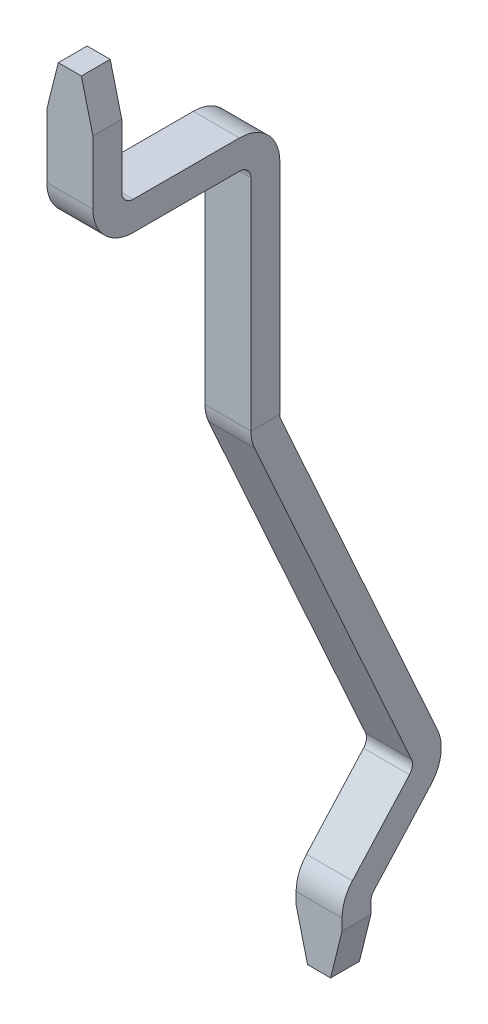
ISO-10303-21;
HEADER;
FILE_DESCRIPTION(('STEP AP214'),'2;1');
FILE_NAME('part.step','',(''),(''),'','','');
FILE_SCHEMA(('AUTOMOTIVE_DESIGN { 1 0 10303 214 1 1 1 1 }'));
ENDSEC;
DATA;
#1=APPLICATION_CONTEXT('core data for automotive mechanical design processes');
#2=APPLICATION_PROTOCOL_DEFINITION('international standard','automotive_design',2000,#1);
#3=PRODUCT_CONTEXT('',#1,'mechanical');
#4=PRODUCT('Part','Part','',(#3));
#5=PRODUCT_RELATED_PRODUCT_CATEGORY('part','',(#4));
#6=PRODUCT_DEFINITION_FORMATION('','',#4);
#7=PRODUCT_DEFINITION_CONTEXT('part definition',#1,'design');
#8=PRODUCT_DEFINITION('design','',#6,#7);
#9=PRODUCT_DEFINITION_SHAPE('','',#8);
#10=(LENGTH_UNIT() NAMED_UNIT(*) SI_UNIT(.MILLI.,.METRE.));
#11=(NAMED_UNIT(*) PLANE_ANGLE_UNIT() SI_UNIT($,.RADIAN.));
#12=(NAMED_UNIT(*) SI_UNIT($,.STERADIAN.) SOLID_ANGLE_UNIT());
#13=UNCERTAINTY_MEASURE_WITH_UNIT(LENGTH_MEASURE(1.E-05),#10,'distance_accuracy_value','');
#14=(GEOMETRIC_REPRESENTATION_CONTEXT(3) GLOBAL_UNCERTAINTY_ASSIGNED_CONTEXT((#13)) GLOBAL_UNIT_ASSIGNED_CONTEXT((#10,
#11,#12)) REPRESENTATION_CONTEXT('',''));
#15=CARTESIAN_POINT('',(0.,0.,0.));
#16=DIRECTION('',(0.,0.,1.));
#17=DIRECTION('',(1.,0.,0.));
#18=AXIS2_PLACEMENT_3D('',#15,#16,#17);
#19=CARTESIAN_POINT('',(1.6,4.575,1.945));
#20=DIRECTION('',(0.,-1.,0.));
#21=DIRECTION('',(0.,0.,-1.));
#22=AXIS2_PLACEMENT_3D('',#19,#20,#21);
#23=PLANE('',#22);
#24=DIRECTION('',(0.,0.,1.));
#25=VECTOR('',#24,1.);
#26=CARTESIAN_POINT('',(1.5,4.575,8.99552393868072));
#27=LINE('',#26,#25);
#28=CARTESIAN_POINT('',(1.5,4.575,1.82));
#29=VERTEX_POINT('',#28);
#30=CARTESIAN_POINT('',(1.5,4.575,2.07));
#31=VERTEX_POINT('',#30);
#32=EDGE_CURVE('E263',#29,#31,#27,.T.);
#33=ORIENTED_EDGE('',*,*,#32,.T.);
#34=DIRECTION('',(-1.,0.,0.));
#35=VECTOR('',#34,1.);
#36=CARTESIAN_POINT('',(1.8,4.575,2.07));
#37=LINE('',#36,#35);
#38=CARTESIAN_POINT('',(1.7,4.575,2.07));
#39=VERTEX_POINT('',#38);
#40=EDGE_CURVE('E234',#31,#39,#37,.F.);
#41=ORIENTED_EDGE('',*,*,#40,.T.);
#42=DIRECTION('',(0.,0.,1.));
#43=VECTOR('',#42,1.);
#44=CARTESIAN_POINT('',(1.7,4.575,8.99552883706733));
#45=LINE('',#44,#43);
#46=CARTESIAN_POINT('',(1.7,4.575,1.82));
#47=VERTEX_POINT('',#46);
#48=EDGE_CURVE('E213',#47,#39,#45,.T.);
#49=ORIENTED_EDGE('',*,*,#48,.F.);
#50=DIRECTION('',(1.,0.,0.));
#51=VECTOR('',#50,1.);
#52=CARTESIAN_POINT('',(1.4,4.575,1.82));
#53=LINE('',#52,#51);
#54=EDGE_CURVE('E250',#47,#29,#53,.F.);
#55=ORIENTED_EDGE('',*,*,#54,.T.);
#56=EDGE_LOOP('',(#33,#41,#49,#55));
#57=FACE_BOUND('',#56,.T.);
#58=ADVANCED_FACE('F16',(#57),#23,.F.);
#59=CARTESIAN_POINT('',(1.5,4.575,8.99552393868072));
#60=DIRECTION('',(0.970142500145331,-0.242535625036336,0.));
#61=DIRECTION('',(0.242535625036336,0.970142500145331,0.));
#62=AXIS2_PLACEMENT_3D('',#59,#60,#61);
#63=PLANE('',#62);
#64=DIRECTION('',(0.242535625036333,0.970142500145332,0.));
#65=VECTOR('',#64,1.);
#66=CARTESIAN_POINT('',(1.4,4.175,2.07));
#67=LINE('',#66,#65);
#68=CARTESIAN_POINT('',(1.4,4.175,2.07));
#69=VERTEX_POINT('',#68);
#70=EDGE_CURVE('E201',#69,#31,#67,.T.);
#71=ORIENTED_EDGE('',*,*,#70,.T.);
#72=ORIENTED_EDGE('',*,*,#32,.F.);
#73=DIRECTION('',(-0.242535625036333,-0.970142500145332,0.));
#74=VECTOR('',#73,1.);
#75=CARTESIAN_POINT('',(1.5,4.575,1.82));
#76=LINE('',#75,#74);
#77=CARTESIAN_POINT('',(1.4,4.175,1.82));
#78=VERTEX_POINT('',#77);
#79=EDGE_CURVE('E230',#29,#78,#76,.T.);
#80=ORIENTED_EDGE('',*,*,#79,.T.);
#81=DIRECTION('',(0.,0.,1.));
#82=VECTOR('',#81,1.);
#83=CARTESIAN_POINT('',(1.4,4.175,2.07));
#84=LINE('',#83,#82);
#85=EDGE_CURVE('E241',#78,#69,#84,.T.);
#86=ORIENTED_EDGE('',*,*,#85,.T.);
#87=EDGE_LOOP('',(#71,#72,#80,#86));
#88=FACE_BOUND('',#87,.T.);
#89=ADVANCED_FACE('F400',(#88),#63,.F.);
#90=CARTESIAN_POINT('',(1.4,4.575,1.82));
#91=DIRECTION('',(0.,0.,1.));
#92=DIRECTION('',(0.,-1.,0.));
#93=AXIS2_PLACEMENT_3D('',#90,#91,#92);
#94=PLANE('',#93);
#95=ORIENTED_EDGE('',*,*,#79,.F.);
#96=ORIENTED_EDGE('',*,*,#54,.F.);
#97=DIRECTION('',(-0.242535625036336,0.970142500145331,0.));
#98=VECTOR('',#97,1.);
#99=CARTESIAN_POINT('',(1.7,4.575,1.82));
#100=LINE('',#99,#98);
#101=CARTESIAN_POINT('',(1.8,4.175,1.82));
#102=VERTEX_POINT('',#101);
#103=EDGE_CURVE('E231',#102,#47,#100,.T.);
#104=ORIENTED_EDGE('',*,*,#103,.F.);
#105=DIRECTION('',(0.,1.,0.));
#106=VECTOR('',#105,1.);
#107=CARTESIAN_POINT('',(1.8,4.575,1.82));
#108=LINE('',#107,#106);
#109=CARTESIAN_POINT('',(1.8,3.625,1.82));
#110=VERTEX_POINT('',#109);
#111=EDGE_CURVE('E220',#102,#110,#108,.F.);
#112=ORIENTED_EDGE('',*,*,#111,.T.);
#113=DIRECTION('',(1.,0.,0.));
#114=VECTOR('',#113,1.);
#115=CARTESIAN_POINT('',(1.6,3.625,1.81999999999999));
#116=LINE('',#115,#114);
#117=CARTESIAN_POINT('',(1.4,3.625,1.82));
#118=VERTEX_POINT('',#117);
#119=EDGE_CURVE('E228',#110,#118,#116,.F.);
#120=ORIENTED_EDGE('',*,*,#119,.T.);
#121=DIRECTION('',(0.,1.,0.));
#122=VECTOR('',#121,1.);
#123=CARTESIAN_POINT('',(1.4,4.575,1.82));
#124=LINE('',#123,#122);
#125=EDGE_CURVE('E245',#118,#78,#124,.T.);
#126=ORIENTED_EDGE('',*,*,#125,.T.);
#127=EDGE_LOOP('',(#95,#96,#104,#112,#120,#126));
#128=FACE_BOUND('',#127,.T.);
#129=ADVANCED_FACE('F395',(#128),#94,.F.);
#130=CARTESIAN_POINT('',(1.6,3.625,1.72));
#131=DIRECTION('',(1.,0.,0.));
#132=DIRECTION('',(0.,1.,0.));
#133=AXIS2_PLACEMENT_3D('',#130,#131,#132);
#134=CYLINDRICAL_SURFACE('',#133,0.0999999999999946);
#135=ORIENTED_EDGE('',*,*,#119,.F.);
#136=CARTESIAN_POINT('',(1.8,3.625,1.72));
#137=DIRECTION('',(1.,0.,0.));
#138=DIRECTION('',(0.,1.,0.));
#139=AXIS2_PLACEMENT_3D('',#136,#137,#138);
#140=CIRCLE('',#139,0.0999999999999946);
#141=CARTESIAN_POINT('',(1.8,3.525,1.72));
#142=VERTEX_POINT('',#141);
#143=EDGE_CURVE('E334',#110,#142,#140,.T.);
#144=ORIENTED_EDGE('',*,*,#143,.T.);
#145=DIRECTION('',(1.,0.,0.));
#146=VECTOR('',#145,1.);
#147=CARTESIAN_POINT('',(1.4,3.525,1.72));
#148=LINE('',#147,#146);
#149=CARTESIAN_POINT('',(1.4,3.525,1.72));
#150=VERTEX_POINT('',#149);
#151=EDGE_CURVE('E226',#142,#150,#148,.F.);
#152=ORIENTED_EDGE('',*,*,#151,.T.);
#153=CARTESIAN_POINT('',(1.4,3.625,1.72));
#154=DIRECTION('',(1.,0.,0.));
#155=DIRECTION('',(0.,1.,0.));
#156=AXIS2_PLACEMENT_3D('',#153,#154,#155);
#157=CIRCLE('',#156,0.0999999999999946);
#158=EDGE_CURVE('E339',#150,#118,#157,.F.);
#159=ORIENTED_EDGE('',*,*,#158,.T.);
#160=EDGE_LOOP('',(#135,#144,#152,#159));
#161=FACE_BOUND('',#160,.T.);
#162=ADVANCED_FACE('F392',(#161),#134,.F.);
#163=CARTESIAN_POINT('',(1.4,3.525,1.72));
#164=DIRECTION('',(0.,-1.,0.));
#165=DIRECTION('',(0.,0.,-1.));
#166=AXIS2_PLACEMENT_3D('',#163,#164,#165);
#167=PLANE('',#166);
#168=ORIENTED_EDGE('',*,*,#151,.F.);
#169=DIRECTION('',(0.,0.,1.));
#170=VECTOR('',#169,1.);
#171=CARTESIAN_POINT('',(1.8,3.525,1.82));
#172=LINE('',#171,#170);
#173=CARTESIAN_POINT('',(1.8,3.525,0.800000000000004));
#174=VERTEX_POINT('',#173);
#175=EDGE_CURVE('E333',#142,#174,#172,.F.);
#176=ORIENTED_EDGE('',*,*,#175,.T.);
#177=DIRECTION('',(-1.,0.,0.));
#178=VECTOR('',#177,1.);
#179=CARTESIAN_POINT('',(1.6,3.525,0.800000000000004));
#180=LINE('',#179,#178);
#181=CARTESIAN_POINT('',(1.4,3.525,0.800000000000004));
#182=VERTEX_POINT('',#181);
#183=EDGE_CURVE('E177',#182,#174,#180,.F.);
#184=ORIENTED_EDGE('',*,*,#183,.F.);
#185=DIRECTION('',(0.,0.,1.));
#186=VECTOR('',#185,1.);
#187=CARTESIAN_POINT('',(1.4,3.525,2.07));
#188=LINE('',#187,#186);
#189=EDGE_CURVE('E342',#182,#150,#188,.T.);
#190=ORIENTED_EDGE('',*,*,#189,.T.);
#191=EDGE_LOOP('',(#168,#176,#184,#190));
#192=FACE_BOUND('',#191,.T.);
#193=ADVANCED_FACE('F383',(#192),#167,.F.);
#194=CARTESIAN_POINT('',(1.6,3.175,0.800000000000004));
#195=DIRECTION('',(-1.,0.,0.));
#196=DIRECTION('',(0.,-1.,0.));
#197=AXIS2_PLACEMENT_3D('',#194,#195,#196);
#198=CYLINDRICAL_SURFACE('',#197,0.350000000000005);
#199=CARTESIAN_POINT('',(1.8,3.175,0.800000000000004));
#200=DIRECTION('',(-1.,0.,0.));
#201=DIRECTION('',(0.,-1.,0.));
#202=AXIS2_PLACEMENT_3D('',#199,#200,#201);
#203=CIRCLE('',#202,0.350000000000005);
#204=CARTESIAN_POINT('',(1.8,3.175,0.45));
#205=VERTEX_POINT('',#204);
#206=EDGE_CURVE('E329',#174,#205,#203,.T.);
#207=ORIENTED_EDGE('',*,*,#206,.T.);
#208=DIRECTION('',(1.,0.,0.));
#209=VECTOR('',#208,1.);
#210=CARTESIAN_POINT('',(1.4,3.175,0.45));
#211=LINE('',#210,#209);
#212=CARTESIAN_POINT('',(1.4,3.175,0.45));
#213=VERTEX_POINT('',#212);
#214=EDGE_CURVE('E217',#205,#213,#211,.F.);
#215=ORIENTED_EDGE('',*,*,#214,.T.);
#216=CARTESIAN_POINT('',(1.4,3.175,0.800000000000004));
#217=DIRECTION('',(-1.,0.,0.));
#218=DIRECTION('',(0.,-1.,0.));
#219=AXIS2_PLACEMENT_3D('',#216,#217,#218);
#220=CIRCLE('',#219,0.350000000000005);
#221=EDGE_CURVE('E187',#213,#182,#220,.F.);
#222=ORIENTED_EDGE('',*,*,#221,.T.);
#223=ORIENTED_EDGE('',*,*,#183,.T.);
#224=EDGE_LOOP('',(#207,#215,#222,#223));
#225=FACE_BOUND('',#224,.T.);
#226=ADVANCED_FACE('F388',(#225),#198,.T.);
#227=CARTESIAN_POINT('',(1.4,3.175,0.45));
#228=DIRECTION('',(0.,0.,1.));
#229=DIRECTION('',(0.,-1.,0.));
#230=AXIS2_PLACEMENT_3D('',#227,#228,#229);
#231=PLANE('',#230);
#232=ORIENTED_EDGE('',*,*,#214,.F.);
#233=DIRECTION('',(0.,1.,0.));
#234=VECTOR('',#233,1.);
#235=CARTESIAN_POINT('',(1.8,4.575,0.449999999999999));
#236=LINE('',#235,#234);
#237=CARTESIAN_POINT('',(1.8,1.275,0.449999999999999));
#238=VERTEX_POINT('',#237);
#239=EDGE_CURVE('E332',#205,#238,#236,.F.);
#240=ORIENTED_EDGE('',*,*,#239,.T.);
#241=DIRECTION('',(1.,0.,0.));
#242=VECTOR('',#241,1.);
#243=CARTESIAN_POINT('',(1.79899999999999,1.275,0.449999999999998));
#244=LINE('',#243,#242);
#245=CARTESIAN_POINT('',(1.799,1.275,0.449999999999999));
#246=VERTEX_POINT('',#245);
#247=EDGE_CURVE('E223',#246,#238,#244,.T.);
#248=ORIENTED_EDGE('',*,*,#247,.F.);
#249=DIRECTION('',(1.,0.,0.));
#250=VECTOR('',#249,1.);
#251=CARTESIAN_POINT('',(1.4,1.275,0.45));
#252=LINE('',#251,#250);
#253=CARTESIAN_POINT('',(1.401,1.275,0.449999999999999));
#254=VERTEX_POINT('',#253);
#255=EDGE_CURVE('E173',#254,#246,#252,.T.);
#256=ORIENTED_EDGE('',*,*,#255,.F.);
#257=DIRECTION('',(1.,0.,0.));
#258=VECTOR('',#257,1.);
#259=CARTESIAN_POINT('',(1.401,1.275,0.45));
#260=LINE('',#259,#258);
#261=CARTESIAN_POINT('',(1.4,1.275,0.45));
#262=VERTEX_POINT('',#261);
#263=EDGE_CURVE('E19',#262,#254,#260,.T.);
#264=ORIENTED_EDGE('',*,*,#263,.F.);
#265=DIRECTION('',(0.,1.,0.));
#266=VECTOR('',#265,1.);
#267=CARTESIAN_POINT('',(1.4,4.575,0.45));
#268=LINE('',#267,#266);
#269=EDGE_CURVE('E171',#262,#213,#268,.T.);
#270=ORIENTED_EDGE('',*,*,#269,.T.);
#271=EDGE_LOOP('',(#232,#240,#248,#256,#264,#270));
#272=FACE_BOUND('',#271,.T.);
#273=ADVANCED_FACE('F170',(#272),#231,.F.);
#274=CARTESIAN_POINT('',(1.8,3.275,1.72));
#275=DIRECTION('',(0.,1.,0.));
#276=DIRECTION('',(0.,0.,1.));
#277=AXIS2_PLACEMENT_3D('',#274,#275,#276);
#278=PLANE('',#277);
#279=DIRECTION('',(1.,0.,0.));
#280=VECTOR('',#279,1.);
#281=CARTESIAN_POINT('',(1.6,3.27500000000001,1.72));
#282=LINE('',#281,#280);
#283=CARTESIAN_POINT('',(1.4,3.275,1.72));
#284=VERTEX_POINT('',#283);
#285=CARTESIAN_POINT('',(1.8,3.275,1.72));
#286=VERTEX_POINT('',#285);
#287=EDGE_CURVE('E202',#284,#286,#282,.T.);
#288=ORIENTED_EDGE('',*,*,#287,.F.);
#289=DIRECTION('',(0.,0.,1.));
#290=VECTOR('',#289,1.);
#291=CARTESIAN_POINT('',(1.4,3.275,2.07));
#292=LINE('',#291,#290);
#293=CARTESIAN_POINT('',(1.4,3.275,0.800000000000004));
#294=VERTEX_POINT('',#293);
#295=EDGE_CURVE('E193',#284,#294,#292,.F.);
#296=ORIENTED_EDGE('',*,*,#295,.T.);
#297=DIRECTION('',(-1.,0.,0.));
#298=VECTOR('',#297,1.);
#299=CARTESIAN_POINT('',(1.6,3.275,0.800000000000004));
#300=LINE('',#299,#298);
#301=CARTESIAN_POINT('',(1.8,3.275,0.800000000000004));
#302=VERTEX_POINT('',#301);
#303=EDGE_CURVE('E218',#294,#302,#300,.F.);
#304=ORIENTED_EDGE('',*,*,#303,.T.);
#305=DIRECTION('',(0.,0.,1.));
#306=VECTOR('',#305,1.);
#307=CARTESIAN_POINT('',(1.8,3.275,1.82));
#308=LINE('',#307,#306);
#309=EDGE_CURVE('E324',#302,#286,#308,.T.);
#310=ORIENTED_EDGE('',*,*,#309,.T.);
#311=EDGE_LOOP('',(#288,#296,#304,#310));
#312=FACE_BOUND('',#311,.T.);
#313=ADVANCED_FACE('F534',(#312),#278,.F.);
#314=CARTESIAN_POINT('',(1.6,3.625,1.72));
#315=DIRECTION('',(1.,0.,0.));
#316=DIRECTION('',(0.,1.,0.));
#317=AXIS2_PLACEMENT_3D('',#314,#315,#316);
#318=CYLINDRICAL_SURFACE('',#317,0.349999999999995);
#319=CARTESIAN_POINT('',(1.4,3.625,1.72));
#320=DIRECTION('',(1.,0.,0.));
#321=DIRECTION('',(0.,1.,0.));
#322=AXIS2_PLACEMENT_3D('',#319,#320,#321);
#323=CIRCLE('',#322,0.349999999999995);
#324=CARTESIAN_POINT('',(1.4,3.625,2.07));
#325=VERTEX_POINT('',#324);
#326=EDGE_CURVE('E195',#325,#284,#323,.T.);
#327=ORIENTED_EDGE('',*,*,#326,.T.);
#328=ORIENTED_EDGE('',*,*,#287,.T.);
#329=CARTESIAN_POINT('',(1.8,3.625,1.72));
#330=DIRECTION('',(1.,0.,0.));
#331=DIRECTION('',(0.,1.,0.));
#332=AXIS2_PLACEMENT_3D('',#329,#330,#331);
#333=CIRCLE('',#332,0.349999999999995);
#334=CARTESIAN_POINT('',(1.8,3.625,2.07));
#335=VERTEX_POINT('',#334);
#336=EDGE_CURVE('E321',#286,#335,#333,.F.);
#337=ORIENTED_EDGE('',*,*,#336,.T.);
#338=DIRECTION('',(-1.,0.,0.));
#339=VECTOR('',#338,1.);
#340=CARTESIAN_POINT('',(1.8,3.625,2.07));
#341=LINE('',#340,#339);
#342=EDGE_CURVE('E198',#335,#325,#341,.T.);
#343=ORIENTED_EDGE('',*,*,#342,.T.);
#344=EDGE_LOOP('',(#327,#328,#337,#343));
#345=FACE_BOUND('',#344,.T.);
#346=ADVANCED_FACE('F531',(#345),#318,.T.);
#347=CARTESIAN_POINT('',(1.8,4.575,2.07));
#348=DIRECTION('',(0.,0.,-1.));
#349=DIRECTION('',(-1.,0.,0.));
#350=AXIS2_PLACEMENT_3D('',#347,#348,#349);
#351=PLANE('',#350);
#352=ORIENTED_EDGE('',*,*,#70,.F.);
#353=DIRECTION('',(0.,1.,0.));
#354=VECTOR('',#353,1.);
#355=CARTESIAN_POINT('',(1.4,4.575,2.07));
#356=LINE('',#355,#354);
#357=EDGE_CURVE('E244',#69,#325,#356,.F.);
#358=ORIENTED_EDGE('',*,*,#357,.T.);
#359=ORIENTED_EDGE('',*,*,#342,.F.);
#360=DIRECTION('',(0.,1.,0.));
#361=VECTOR('',#360,1.);
#362=CARTESIAN_POINT('',(1.8,4.575,2.07));
#363=LINE('',#362,#361);
#364=CARTESIAN_POINT('',(1.8,4.175,2.07));
#365=VERTEX_POINT('',#364);
#366=EDGE_CURVE('E207',#335,#365,#363,.T.);
#367=ORIENTED_EDGE('',*,*,#366,.T.);
#368=DIRECTION('',(-0.242535625036336,0.970142500145331,0.));
#369=VECTOR('',#368,1.);
#370=CARTESIAN_POINT('',(1.7,4.575,2.07));
#371=LINE('',#370,#369);
#372=EDGE_CURVE('E210',#39,#365,#371,.F.);
#373=ORIENTED_EDGE('',*,*,#372,.F.);
#374=ORIENTED_EDGE('',*,*,#40,.F.);
#375=EDGE_LOOP('',(#352,#358,#359,#367,#373,#374));
#376=FACE_BOUND('',#375,.T.);
#377=ADVANCED_FACE('F527',(#376),#351,.F.);
#378=CARTESIAN_POINT('',(1.7,4.575,8.99552883706733));
#379=DIRECTION('',(0.970142500145331,0.242535625036336,0.));
#380=DIRECTION('',(-0.242535625036336,0.970142500145331,0.));
#381=AXIS2_PLACEMENT_3D('',#378,#379,#380);
#382=PLANE('',#381);
#383=ORIENTED_EDGE('',*,*,#372,.T.);
#384=DIRECTION('',(0.,0.,1.));
#385=VECTOR('',#384,1.);
#386=CARTESIAN_POINT('',(1.8,4.175,1.82));
#387=LINE('',#386,#385);
#388=EDGE_CURVE('E203',#365,#102,#387,.F.);
#389=ORIENTED_EDGE('',*,*,#388,.T.);
#390=ORIENTED_EDGE('',*,*,#103,.T.);
#391=ORIENTED_EDGE('',*,*,#48,.T.);
#392=EDGE_LOOP('',(#383,#389,#390,#391));
#393=FACE_BOUND('',#392,.T.);
#394=ADVANCED_FACE('F524',(#393),#382,.T.);
#395=CARTESIAN_POINT('',(1.4,4.575,2.07));
#396=DIRECTION('',(1.,0.,0.));
#397=DIRECTION('',(0.,1.,0.));
#398=AXIS2_PLACEMENT_3D('',#395,#396,#397);
#399=PLANE('',#398);
#400=ORIENTED_EDGE('',*,*,#85,.F.);
#401=ORIENTED_EDGE('',*,*,#125,.F.);
#402=ORIENTED_EDGE('',*,*,#158,.F.);
#403=ORIENTED_EDGE('',*,*,#189,.F.);
#404=ORIENTED_EDGE('',*,*,#221,.F.);
#405=ORIENTED_EDGE('',*,*,#269,.F.);
#406=DIRECTION('',(0.,0.,1.));
#407=VECTOR('',#406,1.);
#408=CARTESIAN_POINT('',(1.4,1.275,2.07));
#409=LINE('',#408,#407);
#410=CARTESIAN_POINT('',(1.4,1.275,0.7));
#411=VERTEX_POINT('',#410);
#412=EDGE_CURVE('E183',#411,#262,#409,.F.);
#413=ORIENTED_EDGE('',*,*,#412,.F.);
#414=DIRECTION('',(0.,1.,0.));
#415=VECTOR('',#414,1.);
#416=CARTESIAN_POINT('',(1.4,3.175,0.7));
#417=LINE('',#416,#415);
#418=CARTESIAN_POINT('',(1.4,3.175,0.7));
#419=VERTEX_POINT('',#418);
#420=EDGE_CURVE('E206',#411,#419,#417,.T.);
#421=ORIENTED_EDGE('',*,*,#420,.T.);
#422=CARTESIAN_POINT('',(1.4,3.175,0.800000000000004));
#423=DIRECTION('',(-1.,0.,0.));
#424=DIRECTION('',(0.,-1.,0.));
#425=AXIS2_PLACEMENT_3D('',#422,#423,#424);
#426=CIRCLE('',#425,0.100000000000005);
#427=EDGE_CURVE('E221',#419,#294,#426,.F.);
#428=ORIENTED_EDGE('',*,*,#427,.T.);
#429=ORIENTED_EDGE('',*,*,#295,.F.);
#430=ORIENTED_EDGE('',*,*,#326,.F.);
#431=ORIENTED_EDGE('',*,*,#357,.F.);
#432=EDGE_LOOP('',(#400,#401,#402,#403,#404,#405,#413,#421,#428,#429,#430,#431));
#433=FACE_BOUND('',#432,.T.);
#434=ADVANCED_FACE('F181',(#433),#399,.F.);
#435=CARTESIAN_POINT('',(1.6,3.175,0.800000000000004));
#436=DIRECTION('',(-1.,0.,0.));
#437=DIRECTION('',(0.,-1.,0.));
#438=AXIS2_PLACEMENT_3D('',#435,#436,#437);
#439=CYLINDRICAL_SURFACE('',#438,0.100000000000005);
#440=ORIENTED_EDGE('',*,*,#303,.F.);
#441=ORIENTED_EDGE('',*,*,#427,.F.);
#442=DIRECTION('',(-1.,0.,0.));
#443=VECTOR('',#442,1.);
#444=CARTESIAN_POINT('',(1.8,3.175,0.7));
#445=LINE('',#444,#443);
#446=CARTESIAN_POINT('',(1.8,3.175,0.7));
#447=VERTEX_POINT('',#446);
#448=EDGE_CURVE('E370',#419,#447,#445,.F.);
#449=ORIENTED_EDGE('',*,*,#448,.T.);
#450=CARTESIAN_POINT('',(1.8,3.175,0.800000000000004));
#451=DIRECTION('',(-1.,0.,0.));
#452=DIRECTION('',(0.,-1.,0.));
#453=AXIS2_PLACEMENT_3D('',#450,#451,#452);
#454=CIRCLE('',#453,0.100000000000005);
#455=EDGE_CURVE('E325',#447,#302,#454,.F.);
#456=ORIENTED_EDGE('',*,*,#455,.T.);
#457=EDGE_LOOP('',(#440,#441,#449,#456));
#458=FACE_BOUND('',#457,.T.);
#459=ADVANCED_FACE('F518',(#458),#439,.F.);
#460=CARTESIAN_POINT('',(1.8,4.575,1.82));
#461=DIRECTION('',(-1.,0.,0.));
#462=DIRECTION('',(0.,0.,1.));
#463=AXIS2_PLACEMENT_3D('',#460,#461,#462);
#464=PLANE('',#463);
#465=ORIENTED_EDGE('',*,*,#366,.F.);
#466=ORIENTED_EDGE('',*,*,#336,.F.);
#467=ORIENTED_EDGE('',*,*,#309,.F.);
#468=ORIENTED_EDGE('',*,*,#455,.F.);
#469=DIRECTION('',(0.,1.,0.));
#470=VECTOR('',#469,1.);
#471=CARTESIAN_POINT('',(1.8,3.175,0.7));
#472=LINE('',#471,#470);
#473=CARTESIAN_POINT('',(1.8,1.275,0.7));
#474=VERTEX_POINT('',#473);
#475=EDGE_CURVE('E358',#447,#474,#472,.F.);
#476=ORIENTED_EDGE('',*,*,#475,.T.);
#477=DIRECTION('',(0.,0.,1.));
#478=VECTOR('',#477,1.);
#479=CARTESIAN_POINT('',(1.8,1.275,1.82));
#480=LINE('',#479,#478);
#481=EDGE_CURVE('E328',#238,#474,#480,.T.);
#482=ORIENTED_EDGE('',*,*,#481,.F.);
#483=ORIENTED_EDGE('',*,*,#239,.F.);
#484=ORIENTED_EDGE('',*,*,#206,.F.);
#485=ORIENTED_EDGE('',*,*,#175,.F.);
#486=ORIENTED_EDGE('',*,*,#143,.F.);
#487=ORIENTED_EDGE('',*,*,#111,.F.);
#488=ORIENTED_EDGE('',*,*,#388,.F.);
#489=EDGE_LOOP('',(#465,#466,#467,#468,#476,#482,#483,#484,#485,#486,#487,#488));
#490=FACE_BOUND('',#489,.T.);
#491=ADVANCED_FACE('F355',(#490),#464,.F.);
#492=CARTESIAN_POINT('',(1.8,3.175,0.7));
#493=DIRECTION('',(0.,0.,-1.));
#494=DIRECTION('',(-1.,0.,0.));
#495=AXIS2_PLACEMENT_3D('',#492,#493,#494);
#496=PLANE('',#495);
#497=ORIENTED_EDGE('',*,*,#448,.F.);
#498=ORIENTED_EDGE('',*,*,#420,.F.);
#499=DIRECTION('',(-1.,0.,0.));
#500=VECTOR('',#499,1.);
#501=CARTESIAN_POINT('',(1.8,1.275,0.7));
#502=LINE('',#501,#500);
#503=CARTESIAN_POINT('',(1.40100000000001,1.275,0.699999999999999));
#504=VERTEX_POINT('',#503);
#505=EDGE_CURVE('E192',#411,#504,#502,.F.);
#506=ORIENTED_EDGE('',*,*,#505,.T.);
#507=DIRECTION('',(1.,0.,0.));
#508=VECTOR('',#507,1.);
#509=CARTESIAN_POINT('',(1.6,1.275,0.699999999999998));
#510=LINE('',#509,#508);
#511=CARTESIAN_POINT('',(1.799,1.275,0.699999999999999));
#512=VERTEX_POINT('',#511);
#513=EDGE_CURVE('E315',#512,#504,#510,.F.);
#514=ORIENTED_EDGE('',*,*,#513,.F.);
#515=DIRECTION('',(-1.,0.,0.));
#516=VECTOR('',#515,1.);
#517=CARTESIAN_POINT('',(1.8,1.275,0.7));
#518=LINE('',#517,#516);
#519=EDGE_CURVE('E316',#512,#474,#518,.F.);
#520=ORIENTED_EDGE('',*,*,#519,.T.);
#521=ORIENTED_EDGE('',*,*,#475,.F.);
#522=EDGE_LOOP('',(#497,#498,#506,#514,#520,#521));
#523=FACE_BOUND('',#522,.T.);
#524=ADVANCED_FACE('F511',(#523),#496,.F.);
#525=CARTESIAN_POINT('',(1.6,-3.275,-0.215));
#526=DIRECTION('',(0.,-1.,0.));
#527=DIRECTION('',(0.,0.,-1.));
#528=AXIS2_PLACEMENT_3D('',#525,#526,#527);
#529=PLANE('',#528);
#530=DIRECTION('',(1.,0.,0.));
#531=VECTOR('',#530,1.);
#532=CARTESIAN_POINT('',(1.8,-3.275,-0.0900000000000004));
#533=LINE('',#532,#531);
#534=CARTESIAN_POINT('',(1.7,-3.275,-0.0900000000000002));
#535=VERTEX_POINT('',#534);
#536=CARTESIAN_POINT('',(1.5,-3.275,-0.0900000000000002));
#537=VERTEX_POINT('',#536);
#538=EDGE_CURVE('E637',#535,#537,#533,.F.);
#539=ORIENTED_EDGE('',*,*,#538,.T.);
#540=DIRECTION('',(0.,0.,1.));
#541=VECTOR('',#540,1.);
#542=CARTESIAN_POINT('',(1.5,-3.275,-7.84552393868072));
#543=LINE('',#542,#541);
#544=CARTESIAN_POINT('',(1.5,-3.275,-0.34));
#545=VERTEX_POINT('',#544);
#546=EDGE_CURVE('E319',#537,#545,#543,.F.);
#547=ORIENTED_EDGE('',*,*,#546,.T.);
#548=DIRECTION('',(1.,0.,0.));
#549=VECTOR('',#548,1.);
#550=CARTESIAN_POINT('',(1.4,-3.275,-0.34));
#551=LINE('',#550,#549);
#552=CARTESIAN_POINT('',(1.7,-3.275,-0.34));
#553=VERTEX_POINT('',#552);
#554=EDGE_CURVE('E594',#545,#553,#551,.T.);
#555=ORIENTED_EDGE('',*,*,#554,.T.);
#556=DIRECTION('',(0.,0.,1.));
#557=VECTOR('',#556,1.);
#558=CARTESIAN_POINT('',(1.7,-3.275,-7.84552393868072));
#559=LINE('',#558,#557);
#560=EDGE_CURVE('E320',#535,#553,#559,.F.);
#561=ORIENTED_EDGE('',*,*,#560,.F.);
#562=EDGE_LOOP('',(#539,#547,#555,#561));
#563=FACE_BOUND('',#562,.T.);
#564=ADVANCED_FACE('F507',(#563),#529,.T.);
#565=CARTESIAN_POINT('',(1.7,-3.275,-7.84552393868072));
#566=DIRECTION('',(0.970710817842158,-0.240250927415917,0.));
#567=DIRECTION('',(0.240250927415917,0.970710817842158,0.));
#568=AXIS2_PLACEMENT_3D('',#565,#566,#567);
#569=PLANE('',#568);
#570=DIRECTION('',(-0.240250927415917,-0.970710817842158,0.));
#571=VECTOR('',#570,1.);
#572=CARTESIAN_POINT('',(1.79899999999999,-2.875,-0.0900000000000001));
#573=LINE('',#572,#571);
#574=CARTESIAN_POINT('',(1.79899999999999,-2.875,-0.0900000000000001));
#575=VERTEX_POINT('',#574);
#576=EDGE_CURVE('E633',#575,#535,#573,.T.);
#577=ORIENTED_EDGE('',*,*,#576,.T.);
#578=ORIENTED_EDGE('',*,*,#560,.T.);
#579=DIRECTION('',(0.240250927415917,0.970710817842158,0.));
#580=VECTOR('',#579,1.);
#581=CARTESIAN_POINT('',(1.7,-3.275,-0.34));
#582=LINE('',#581,#580);
#583=CARTESIAN_POINT('',(1.79899999999999,-2.875,-0.34));
#584=VERTEX_POINT('',#583);
#585=EDGE_CURVE('E590',#553,#584,#582,.T.);
#586=ORIENTED_EDGE('',*,*,#585,.T.);
#587=DIRECTION('',(0.,0.,-1.));
#588=VECTOR('',#587,1.);
#589=CARTESIAN_POINT('',(1.799,-2.875,0.7));
#590=LINE('',#589,#588);
#591=EDGE_CURVE('E580',#575,#584,#590,.T.);
#592=ORIENTED_EDGE('',*,*,#591,.F.);
#593=EDGE_LOOP('',(#577,#578,#586,#592));
#594=FACE_BOUND('',#593,.T.);
#595=ADVANCED_FACE('F504',(#594),#569,.T.);
#596=CARTESIAN_POINT('',(1.79899999999999,1.275,-0.95));
#597=DIRECTION('',(0.,1.,0.));
#598=DIRECTION('',(0.,0.,1.));
#599=AXIS2_PLACEMENT_3D('',#596,#597,#598);
#600=PLANE('',#599);
#601=ORIENTED_EDGE('',*,*,#519,.F.);
#602=DIRECTION('',(0.,0.,-1.));
#603=VECTOR('',#602,1.);
#604=CARTESIAN_POINT('',(1.799,1.275,0.7));
#605=LINE('',#604,#603);
#606=EDGE_CURVE('E305',#246,#512,#605,.F.);
#607=ORIENTED_EDGE('',*,*,#606,.F.);
#608=ORIENTED_EDGE('',*,*,#247,.T.);
#609=ORIENTED_EDGE('',*,*,#481,.T.);
#610=EDGE_LOOP('',(#601,#607,#608,#609));
#611=FACE_BOUND('',#610,.T.);
#612=ADVANCED_FACE('F348',(#611),#600,.F.);
#613=CARTESIAN_POINT('',(1.5,-3.275,-7.84552393868072));
#614=DIRECTION('',(0.970710817842158,0.240250927415917,0.));
#615=DIRECTION('',(-0.240250927415917,0.970710817842158,0.));
#616=AXIS2_PLACEMENT_3D('',#613,#614,#615);
#617=PLANE('',#616);
#618=DIRECTION('',(-0.240250927415917,0.970710817842158,0.));
#619=VECTOR('',#618,1.);
#620=CARTESIAN_POINT('',(1.5,-3.275,-0.0900000000000004));
#621=LINE('',#620,#619);
#622=CARTESIAN_POINT('',(1.40100000000001,-2.875,-0.0900000000000001));
#623=VERTEX_POINT('',#622);
#624=EDGE_CURVE('E634',#537,#623,#621,.T.);
#625=ORIENTED_EDGE('',*,*,#624,.T.);
#626=DIRECTION('',(0.,0.,1.));
#627=VECTOR('',#626,1.);
#628=CARTESIAN_POINT('',(1.401,-2.875,0.7));
#629=LINE('',#628,#627);
#630=CARTESIAN_POINT('',(1.40100000000001,-2.875,-0.34));
#631=VERTEX_POINT('',#630);
#632=EDGE_CURVE('E293',#631,#623,#629,.T.);
#633=ORIENTED_EDGE('',*,*,#632,.F.);
#634=DIRECTION('',(0.240250927415917,-0.970710817842158,0.));
#635=VECTOR('',#634,1.);
#636=CARTESIAN_POINT('',(1.40100000000001,-2.875,-0.34));
#637=LINE('',#636,#635);
#638=EDGE_CURVE('E608',#631,#545,#637,.T.);
#639=ORIENTED_EDGE('',*,*,#638,.T.);
#640=ORIENTED_EDGE('',*,*,#546,.F.);
#641=EDGE_LOOP('',(#625,#633,#639,#640));
#642=FACE_BOUND('',#641,.T.);
#643=ADVANCED_FACE('F497',(#642),#617,.F.);
#644=CARTESIAN_POINT('',(1.8,-2.775,-0.0900000000000001));
#645=DIRECTION('',(0.,0.,-1.));
#646=DIRECTION('',(0.,1.,0.));
#647=AXIS2_PLACEMENT_3D('',#644,#645,#646);
#648=PLANE('',#647);
#649=DIRECTION('',(0.,1.,0.));
#650=VECTOR('',#649,1.);
#651=CARTESIAN_POINT('',(1.79899999999999,-3.275,-0.0900000000000001));
#652=LINE('',#651,#650);
#653=CARTESIAN_POINT('',(1.79899999999999,-2.775,-0.0900000000000025));
#654=VERTEX_POINT('',#653);
#655=EDGE_CURVE('E586',#654,#575,#652,.F.);
#656=ORIENTED_EDGE('',*,*,#655,.F.);
#657=DIRECTION('',(1.,0.,0.));
#658=VECTOR('',#657,1.);
#659=CARTESIAN_POINT('',(1.6,-2.775,-0.090000000000005));
#660=LINE('',#659,#658);
#661=CARTESIAN_POINT('',(1.40100000000001,-2.775,-0.0900000000000025));
#662=VERTEX_POINT('',#661);
#663=EDGE_CURVE('E631',#662,#654,#660,.T.);
#664=ORIENTED_EDGE('',*,*,#663,.F.);
#665=DIRECTION('',(0.,1.,0.));
#666=VECTOR('',#665,1.);
#667=CARTESIAN_POINT('',(1.40100000000001,-3.275,-0.0900000000000001));
#668=LINE('',#667,#666);
#669=EDGE_CURVE('E289',#623,#662,#668,.T.);
#670=ORIENTED_EDGE('',*,*,#669,.F.);
#671=ORIENTED_EDGE('',*,*,#624,.F.);
#672=ORIENTED_EDGE('',*,*,#538,.F.);
#673=ORIENTED_EDGE('',*,*,#576,.F.);
#674=EDGE_LOOP('',(#656,#664,#670,#671,#672,#673));
#675=FACE_BOUND('',#674,.T.);
#676=ADVANCED_FACE('F493',(#675),#648,.F.);
#677=CARTESIAN_POINT('',(1.6,-2.775,-0.44));
#678=DIRECTION('',(1.,0.,0.));
#679=DIRECTION('',(0.,1.,0.));
#680=AXIS2_PLACEMENT_3D('',#677,#678,#679);
#681=CYLINDRICAL_SURFACE('',#680,0.349999999999995);
#682=CARTESIAN_POINT('',(1.79899999999999,-2.775,-0.44));
#683=DIRECTION('',(1.,0.,0.));
#684=DIRECTION('',(0.,1.,0.));
#685=AXIS2_PLACEMENT_3D('',#682,#683,#684);
#686=CIRCLE('',#685,0.349999999999995);
#687=CARTESIAN_POINT('',(1.79899999999999,-2.54075423726739,-0.179944385482999));
#688=VERTEX_POINT('',#687);
#689=EDGE_CURVE('E294',#688,#654,#686,.T.);
#690=ORIENTED_EDGE('',*,*,#689,.F.);
#691=DIRECTION('',(1.,0.,0.));
#692=VECTOR('',#691,1.);
#693=CARTESIAN_POINT('',(1.8,-2.54075423726739,-0.179944385483));
#694=LINE('',#693,#692);
#695=CARTESIAN_POINT('',(1.40100000000001,-2.54075423726739,-0.179944385482999));
#696=VERTEX_POINT('',#695);
#697=EDGE_CURVE('E628',#688,#696,#694,.F.);
#698=ORIENTED_EDGE('',*,*,#697,.T.);
#699=CARTESIAN_POINT('',(1.40100000000001,-2.775,-0.44));
#700=DIRECTION('',(1.,0.,0.));
#701=DIRECTION('',(0.,1.,0.));
#702=AXIS2_PLACEMENT_3D('',#699,#700,#701);
#703=CIRCLE('',#702,0.349999999999995);
#704=EDGE_CURVE('E287',#662,#696,#703,.F.);
#705=ORIENTED_EDGE('',*,*,#704,.F.);
#706=ORIENTED_EDGE('',*,*,#663,.T.);
#707=EDGE_LOOP('',(#690,#698,#705,#706));
#708=FACE_BOUND('',#707,.T.);
#709=ADVANCED_FACE('F489',(#708),#681,.T.);
#710=CARTESIAN_POINT('',(1.8,-1.99192736078075,-0.67430160414772));
#711=DIRECTION('',(0.,-0.669273607807463,-0.743016041477155));
#712=DIRECTION('',(0.,0.743016041477155,-0.669273607807463));
#713=AXIS2_PLACEMENT_3D('',#710,#711,#712);
#714=PLANE('',#713);
#715=ORIENTED_EDGE('',*,*,#697,.F.);
#716=DIRECTION('',(0.,-0.743016041477151,0.669273607807469));
#717=VECTOR('',#716,1.);
#718=CARTESIAN_POINT('',(1.79899999999999,-1.99192736078075,-0.67430160414772));
#719=LINE('',#718,#717);
#720=CARTESIAN_POINT('',(1.79899999999999,-1.99192736078075,-0.67430160414772));
#721=VERTEX_POINT('',#720);
#722=EDGE_CURVE('E297',#721,#688,#719,.T.);
#723=ORIENTED_EDGE('',*,*,#722,.F.);
#724=DIRECTION('',(-1.,0.,0.));
#725=VECTOR('',#724,1.);
#726=CARTESIAN_POINT('',(1.6,-1.99192736078075,-0.67430160414772));
#727=LINE('',#726,#725);
#728=CARTESIAN_POINT('',(1.40100000000001,-1.99192736078075,-0.674301604147719));
#729=VERTEX_POINT('',#728);
#730=EDGE_CURVE('E625',#721,#729,#727,.T.);
#731=ORIENTED_EDGE('',*,*,#730,.T.);
#732=DIRECTION('',(0.,0.743016041477151,-0.669273607807469));
#733=VECTOR('',#732,1.);
#734=CARTESIAN_POINT('',(1.40100000000001,-2.54075423726739,-0.179944385482996));
#735=LINE('',#734,#733);
#736=EDGE_CURVE('E286',#696,#729,#735,.T.);
#737=ORIENTED_EDGE('',*,*,#736,.F.);
#738=EDGE_LOOP('',(#715,#723,#731,#737));
#739=FACE_BOUND('',#738,.T.);
#740=ADVANCED_FACE('F485',(#739),#714,.F.);
#741=CARTESIAN_POINT('',(1.6,-1.925,-0.6));
#742=DIRECTION('',(-1.,0.,0.));
#743=DIRECTION('',(0.,-1.,0.));
#744=AXIS2_PLACEMENT_3D('',#741,#742,#743);
#745=CYLINDRICAL_SURFACE('',#744,0.100000000000005);
#746=ORIENTED_EDGE('',*,*,#730,.F.);
#747=CARTESIAN_POINT('',(1.79899999999999,-1.925,-0.6));
#748=DIRECTION('',(-1.,0.,0.));
#749=DIRECTION('',(0.,-1.,0.));
#750=AXIS2_PLACEMENT_3D('',#747,#748,#749);
#751=CIRCLE('',#750,0.100000000000005);
#752=CARTESIAN_POINT('',(1.79899999999999,-1.88387647540836,-0.69115292494024));
#753=VERTEX_POINT('',#752);
#754=EDGE_CURVE('E298',#753,#721,#751,.T.);
#755=ORIENTED_EDGE('',*,*,#754,.F.);
#756=DIRECTION('',(1.,0.,0.));
#757=VECTOR('',#756,1.);
#758=CARTESIAN_POINT('',(1.8,-1.88387647540836,-0.691152924940239));
#759=LINE('',#758,#757);
#760=CARTESIAN_POINT('',(1.40100000000001,-1.88387647540836,-0.691152924940241));
#761=VERTEX_POINT('',#760);
#762=EDGE_CURVE('E622',#753,#761,#759,.F.);
#763=ORIENTED_EDGE('',*,*,#762,.T.);
#764=CARTESIAN_POINT('',(1.40100000000001,-1.925,-0.6));
#765=DIRECTION('',(-1.,0.,0.));
#766=DIRECTION('',(0.,-1.,0.));
#767=AXIS2_PLACEMENT_3D('',#764,#765,#766);
#768=CIRCLE('',#767,0.100000000000005);
#769=EDGE_CURVE('E284',#729,#761,#768,.F.);
#770=ORIENTED_EDGE('',*,*,#769,.F.);
#771=EDGE_LOOP('',(#746,#755,#763,#770));
#772=FACE_BOUND('',#771,.T.);
#773=ADVANCED_FACE('F481',(#772),#745,.F.);
#774=CARTESIAN_POINT('',(1.8,1.13106766392928,0.669035237290843));
#775=DIRECTION('',(0.,0.411235245916341,-0.911529249402413));
#776=DIRECTION('',(0.,0.911529249402413,0.411235245916341));
#777=AXIS2_PLACEMENT_3D('',#774,#775,#776);
#778=PLANE('',#777);
#779=ORIENTED_EDGE('',*,*,#762,.F.);
#780=DIRECTION('',(0.,-0.911529249402413,-0.411235245916341));
#781=VECTOR('',#780,1.);
#782=CARTESIAN_POINT('',(1.799,1.13106766392928,0.669035237290843));
#783=LINE('',#782,#781);
#784=CARTESIAN_POINT('',(1.799,1.13106766392928,0.669035237290843));
#785=VERTEX_POINT('',#784);
#786=EDGE_CURVE('E301',#785,#753,#783,.T.);
#787=ORIENTED_EDGE('',*,*,#786,.F.);
#788=DIRECTION('',(1.,0.,0.));
#789=VECTOR('',#788,1.);
#790=CARTESIAN_POINT('',(1.6,1.13106766392928,0.669035237290842));
#791=LINE('',#790,#789);
#792=CARTESIAN_POINT('',(1.40100000000001,1.13106766392928,0.669035237290843));
#793=VERTEX_POINT('',#792);
#794=EDGE_CURVE('E620',#793,#785,#791,.T.);
#795=ORIENTED_EDGE('',*,*,#794,.F.);
#796=DIRECTION('',(0.,0.911529249402413,0.411235245916341));
#797=VECTOR('',#796,1.);
#798=CARTESIAN_POINT('',(1.40100000000001,-1.88387647540836,-0.69115292494024));
#799=LINE('',#798,#797);
#800=EDGE_CURVE('E283',#761,#793,#799,.T.);
#801=ORIENTED_EDGE('',*,*,#800,.F.);
#802=EDGE_LOOP('',(#779,#787,#795,#801));
#803=FACE_BOUND('',#802,.T.);
#804=ADVANCED_FACE('F477',(#803),#778,.F.);
#805=CARTESIAN_POINT('',(1.6,1.275,0.350000000000003));
#806=DIRECTION('',(1.,0.,0.));
#807=DIRECTION('',(0.,1.,0.));
#808=AXIS2_PLACEMENT_3D('',#805,#806,#807);
#809=CYLINDRICAL_SURFACE('',#808,0.349999999999995);
#810=CARTESIAN_POINT('',(1.799,1.275,0.350000000000003));
#811=DIRECTION('',(1.,0.,0.));
#812=DIRECTION('',(0.,1.,0.));
#813=AXIS2_PLACEMENT_3D('',#810,#811,#812);
#814=CIRCLE('',#813,0.349999999999995);
#815=EDGE_CURVE('E302',#512,#785,#814,.T.);
#816=ORIENTED_EDGE('',*,*,#815,.F.);
#817=ORIENTED_EDGE('',*,*,#513,.T.);
#818=CARTESIAN_POINT('',(1.40100000000001,1.275,0.350000000000003));
#819=DIRECTION('',(1.,0.,0.));
#820=DIRECTION('',(0.,1.,0.));
#821=AXIS2_PLACEMENT_3D('',#818,#819,#820);
#822=CIRCLE('',#821,0.349999999999995);
#823=EDGE_CURVE('E280',#793,#504,#822,.F.);
#824=ORIENTED_EDGE('',*,*,#823,.F.);
#825=ORIENTED_EDGE('',*,*,#794,.T.);
#826=EDGE_LOOP('',(#816,#817,#824,#825));
#827=FACE_BOUND('',#826,.T.);
#828=ADVANCED_FACE('F474',(#827),#809,.T.);
#829=CARTESIAN_POINT('',(1.401,1.275,0.7));
#830=DIRECTION('',(0.,1.,0.));
#831=DIRECTION('',(0.,0.,1.));
#832=AXIS2_PLACEMENT_3D('',#829,#830,#831);
#833=PLANE('',#832);
#834=ORIENTED_EDGE('',*,*,#505,.F.);
#835=ORIENTED_EDGE('',*,*,#412,.T.);
#836=ORIENTED_EDGE('',*,*,#263,.T.);
#837=DIRECTION('',(0.,0.,1.));
#838=VECTOR('',#837,1.);
#839=CARTESIAN_POINT('',(1.401,1.275,0.7));
#840=LINE('',#839,#838);
#841=EDGE_CURVE('E279',#504,#254,#840,.F.);
#842=ORIENTED_EDGE('',*,*,#841,.F.);
#843=EDGE_LOOP('',(#834,#835,#836,#842));
#844=FACE_BOUND('',#843,.T.);
#845=ADVANCED_FACE('F190',(#844),#833,.F.);
#846=CARTESIAN_POINT('',(1.4,-2.15924576273261,-0.860055614517));
#847=DIRECTION('',(0.,0.669273607807463,0.743016041477155));
#848=DIRECTION('',(0.,-0.743016041477155,0.669273607807463));
#849=AXIS2_PLACEMENT_3D('',#846,#847,#848);
#850=PLANE('',#849);
#851=DIRECTION('',(-1.,0.,0.));
#852=VECTOR('',#851,1.);
#853=CARTESIAN_POINT('',(1.6,-2.15924576273262,-0.860055614517007));
#854=LINE('',#853,#852);
#855=CARTESIAN_POINT('',(1.79899999999999,-2.15924576273261,-0.860055614517005));
#856=VERTEX_POINT('',#855);
#857=CARTESIAN_POINT('',(1.40100000000001,-2.15924576273261,-0.860055614517005));
#858=VERTEX_POINT('',#857);
#859=EDGE_CURVE('E436',#856,#858,#854,.T.);
#860=ORIENTED_EDGE('',*,*,#859,.F.);
#861=DIRECTION('',(0.,0.743016041477162,-0.669273607807455));
#862=VECTOR('',#861,1.);
#863=CARTESIAN_POINT('',(1.79899999999999,-2.70807263921926,-0.365698395852285));
#864=LINE('',#863,#862);
#865=CARTESIAN_POINT('',(1.79899999999999,-2.70807263921926,-0.365698395852286));
#866=VERTEX_POINT('',#865);
#867=EDGE_CURVE('E308',#866,#856,#864,.T.);
#868=ORIENTED_EDGE('',*,*,#867,.F.);
#869=DIRECTION('',(1.,0.,0.));
#870=VECTOR('',#869,1.);
#871=CARTESIAN_POINT('',(1.6,-2.70807263921926,-0.365698395852285));
#872=LINE('',#871,#870);
#873=CARTESIAN_POINT('',(1.40100000000001,-2.70807263921926,-0.365698395852286));
#874=VERTEX_POINT('',#873);
#875=EDGE_CURVE('E314',#866,#874,#872,.F.);
#876=ORIENTED_EDGE('',*,*,#875,.T.);
#877=DIRECTION('',(0.,-0.743016041477162,0.669273607807455));
#878=VECTOR('',#877,1.);
#879=CARTESIAN_POINT('',(1.40100000000001,-2.15924576273261,-0.860055614517));
#880=LINE('',#879,#878);
#881=EDGE_CURVE('E274',#858,#874,#880,.T.);
#882=ORIENTED_EDGE('',*,*,#881,.F.);
#883=EDGE_LOOP('',(#860,#868,#876,#882));
#884=FACE_BOUND('',#883,.T.);
#885=ADVANCED_FACE('F467',(#884),#850,.F.);
#886=CARTESIAN_POINT('',(1.6,-2.775,-0.44));
#887=DIRECTION('',(1.,0.,0.));
#888=DIRECTION('',(0.,1.,0.));
#889=AXIS2_PLACEMENT_3D('',#886,#887,#888);
#890=CYLINDRICAL_SURFACE('',#889,0.0999999999999952);
#891=ORIENTED_EDGE('',*,*,#875,.F.);
#892=CARTESIAN_POINT('',(1.79899999999999,-2.775,-0.44));
#893=DIRECTION('',(1.,0.,0.));
#894=DIRECTION('',(0.,1.,0.));
#895=AXIS2_PLACEMENT_3D('',#892,#893,#894);
#896=CIRCLE('',#895,0.0999999999999952);
#897=CARTESIAN_POINT('',(1.79899999999999,-2.775,-0.34));
#898=VERTEX_POINT('',#897);
#899=EDGE_CURVE('E309',#898,#866,#896,.F.);
#900=ORIENTED_EDGE('',*,*,#899,.F.);
#901=DIRECTION('',(1.,0.,0.));
#902=VECTOR('',#901,1.);
#903=CARTESIAN_POINT('',(1.4,-2.775,-0.34));
#904=LINE('',#903,#902);
#905=CARTESIAN_POINT('',(1.40100000000001,-2.775,-0.34));
#906=VERTEX_POINT('',#905);
#907=EDGE_CURVE('E597',#898,#906,#904,.F.);
#908=ORIENTED_EDGE('',*,*,#907,.T.);
#909=CARTESIAN_POINT('',(1.40100000000001,-2.775,-0.44));
#910=DIRECTION('',(1.,0.,0.));
#911=DIRECTION('',(0.,1.,0.));
#912=AXIS2_PLACEMENT_3D('',#909,#910,#911);
#913=CIRCLE('',#912,0.0999999999999952);
#914=EDGE_CURVE('E270',#874,#906,#913,.T.);
#915=ORIENTED_EDGE('',*,*,#914,.F.);
#916=EDGE_LOOP('',(#891,#900,#908,#915));
#917=FACE_BOUND('',#916,.T.);
#918=ADVANCED_FACE('F463',(#917),#890,.F.);
#919=CARTESIAN_POINT('',(1.4,-2.775,-0.34));
#920=DIRECTION('',(0.,0.,1.));
#921=DIRECTION('',(0.,-1.,0.));
#922=AXIS2_PLACEMENT_3D('',#919,#920,#921);
#923=PLANE('',#922);
#924=ORIENTED_EDGE('',*,*,#554,.F.);
#925=ORIENTED_EDGE('',*,*,#638,.F.);
#926=DIRECTION('',(0.,1.,0.));
#927=VECTOR('',#926,1.);
#928=CARTESIAN_POINT('',(1.40100000000001,-3.275,-0.34));
#929=LINE('',#928,#927);
#930=EDGE_CURVE('E273',#906,#631,#929,.F.);
#931=ORIENTED_EDGE('',*,*,#930,.F.);
#932=ORIENTED_EDGE('',*,*,#907,.F.);
#933=DIRECTION('',(0.,1.,0.));
#934=VECTOR('',#933,1.);
#935=CARTESIAN_POINT('',(1.79899999999999,-3.275,-0.34));
#936=LINE('',#935,#934);
#937=EDGE_CURVE('E312',#584,#898,#936,.T.);
#938=ORIENTED_EDGE('',*,*,#937,.F.);
#939=ORIENTED_EDGE('',*,*,#585,.F.);
#940=EDGE_LOOP('',(#924,#925,#931,#932,#938,#939));
#941=FACE_BOUND('',#940,.T.);
#942=ADVANCED_FACE('F460',(#941),#923,.F.);
#943=CARTESIAN_POINT('',(1.6,-1.925,-0.6));
#944=DIRECTION('',(-1.,0.,0.));
#945=DIRECTION('',(0.,-1.,0.));
#946=AXIS2_PLACEMENT_3D('',#943,#944,#945);
#947=CYLINDRICAL_SURFACE('',#946,0.350000000000005);
#948=DIRECTION('',(1.,0.,0.));
#949=VECTOR('',#948,1.);
#950=CARTESIAN_POINT('',(1.4,-1.78106766392928,-0.919035237290846));
#951=LINE('',#950,#949);
#952=CARTESIAN_POINT('',(1.40100000000001,-1.78106766392928,-0.919035237290846));
#953=VERTEX_POINT('',#952);
#954=CARTESIAN_POINT('',(1.79899999999999,-1.78106766392928,-0.919035237290846));
#955=VERTEX_POINT('',#954);
#956=EDGE_CURVE('E423',#953,#955,#951,.T.);
#957=ORIENTED_EDGE('',*,*,#956,.T.);
#958=CARTESIAN_POINT('',(1.79899999999999,-1.925,-0.6));
#959=DIRECTION('',(-1.,0.,0.));
#960=DIRECTION('',(0.,-1.,0.));
#961=AXIS2_PLACEMENT_3D('',#958,#959,#960);
#962=CIRCLE('',#961,0.350000000000005);
#963=EDGE_CURVE('E306',#856,#955,#962,.F.);
#964=ORIENTED_EDGE('',*,*,#963,.F.);
#965=ORIENTED_EDGE('',*,*,#859,.T.);
#966=CARTESIAN_POINT('',(1.40100000000001,-1.925,-0.6));
#967=DIRECTION('',(-1.,0.,0.));
#968=DIRECTION('',(0.,-1.,0.));
#969=AXIS2_PLACEMENT_3D('',#966,#967,#968);
#970=CIRCLE('',#969,0.350000000000005);
#971=EDGE_CURVE('E275',#953,#858,#970,.T.);
#972=ORIENTED_EDGE('',*,*,#971,.F.);
#973=EDGE_LOOP('',(#957,#964,#965,#972));
#974=FACE_BOUND('',#973,.T.);
#975=ADVANCED_FACE('F434',(#974),#947,.T.);
#976=CARTESIAN_POINT('',(1.799,-3.275,0.7));
#977=DIRECTION('',(1.,0.,0.));
#978=DIRECTION('',(0.,0.,-1.));
#979=AXIS2_PLACEMENT_3D('',#976,#977,#978);
#980=PLANE('',#979);
#981=ORIENTED_EDGE('',*,*,#722,.T.);
#982=ORIENTED_EDGE('',*,*,#689,.T.);
#983=ORIENTED_EDGE('',*,*,#655,.T.);
#984=ORIENTED_EDGE('',*,*,#591,.T.);
#985=ORIENTED_EDGE('',*,*,#937,.T.);
#986=ORIENTED_EDGE('',*,*,#899,.T.);
#987=ORIENTED_EDGE('',*,*,#867,.T.);
#988=ORIENTED_EDGE('',*,*,#963,.T.);
#989=DIRECTION('',(0.,-0.911529249402413,-0.411235245916341));
#990=VECTOR('',#989,1.);
#991=CARTESIAN_POINT('',(1.79899999999999,1.23387647540837,0.44115292494024));
#992=LINE('',#991,#990);
#993=CARTESIAN_POINT('',(1.79899999999999,1.23387647540837,0.44115292494024));
#994=VERTEX_POINT('',#993);
#995=EDGE_CURVE('E429',#955,#994,#992,.F.);
#996=ORIENTED_EDGE('',*,*,#995,.T.);
#997=CARTESIAN_POINT('',(1.799,1.275,0.350000000000003));
#998=DIRECTION('',(1.,0.,0.));
#999=DIRECTION('',(0.,1.,0.));
#1000=AXIS2_PLACEMENT_3D('',#997,#998,#999);
#1001=CIRCLE('',#1000,0.0999999999999948);
#1002=EDGE_CURVE('E290',#994,#246,#1001,.F.);
#1003=ORIENTED_EDGE('',*,*,#1002,.T.);
#1004=ORIENTED_EDGE('',*,*,#606,.T.);
#1005=ORIENTED_EDGE('',*,*,#815,.T.);
#1006=ORIENTED_EDGE('',*,*,#786,.T.);
#1007=ORIENTED_EDGE('',*,*,#754,.T.);
#1008=EDGE_LOOP('',(#981,#982,#983,#984,#985,#986,#987,#988,#996,#1003,#1004,#1005,#1006,#1007));
#1009=FACE_BOUND('',#1008,.T.);
#1010=ADVANCED_FACE('F451',(#1009),#980,.T.);
#1011=CARTESIAN_POINT('',(1.6,1.275,0.350000000000003));
#1012=DIRECTION('',(1.,0.,0.));
#1013=DIRECTION('',(0.,1.,0.));
#1014=AXIS2_PLACEMENT_3D('',#1011,#1012,#1013);
#1015=CYLINDRICAL_SURFACE('',#1014,0.0999999999999948);
#1016=ORIENTED_EDGE('',*,*,#255,.T.);
#1017=ORIENTED_EDGE('',*,*,#1002,.F.);
#1018=DIRECTION('',(1.,0.,0.));
#1019=VECTOR('',#1018,1.);
#1020=CARTESIAN_POINT('',(1.4,1.23387647540837,0.44115292494024));
#1021=LINE('',#1020,#1019);
#1022=CARTESIAN_POINT('',(1.40100000000001,1.23387647540837,0.44115292494024));
#1023=VERTEX_POINT('',#1022);
#1024=EDGE_CURVE('E25',#994,#1023,#1021,.F.);
#1025=ORIENTED_EDGE('',*,*,#1024,.T.);
#1026=CARTESIAN_POINT('',(1.40100000000001,1.275,0.350000000000003));
#1027=DIRECTION('',(1.,0.,0.));
#1028=DIRECTION('',(0.,1.,0.));
#1029=AXIS2_PLACEMENT_3D('',#1026,#1027,#1028);
#1030=CIRCLE('',#1029,0.0999999999999948);
#1031=EDGE_CURVE('E33',#254,#1023,#1030,.T.);
#1032=ORIENTED_EDGE('',*,*,#1031,.F.);
#1033=EDGE_LOOP('',(#1016,#1017,#1025,#1032));
#1034=FACE_BOUND('',#1033,.T.);
#1035=ADVANCED_FACE('F443',(#1034),#1015,.F.);
#1036=CARTESIAN_POINT('',(1.401,-3.275,0.7));
#1037=DIRECTION('',(-1.,0.,0.));
#1038=DIRECTION('',(0.,0.,1.));
#1039=AXIS2_PLACEMENT_3D('',#1036,#1037,#1038);
#1040=PLANE('',#1039);
#1041=ORIENTED_EDGE('',*,*,#914,.T.);
#1042=ORIENTED_EDGE('',*,*,#930,.T.);
#1043=ORIENTED_EDGE('',*,*,#632,.T.);
#1044=ORIENTED_EDGE('',*,*,#669,.T.);
#1045=ORIENTED_EDGE('',*,*,#704,.T.);
#1046=ORIENTED_EDGE('',*,*,#736,.T.);
#1047=ORIENTED_EDGE('',*,*,#769,.T.);
#1048=ORIENTED_EDGE('',*,*,#800,.T.);
#1049=ORIENTED_EDGE('',*,*,#823,.T.);
#1050=ORIENTED_EDGE('',*,*,#841,.T.);
#1051=ORIENTED_EDGE('',*,*,#1031,.T.);
#1052=DIRECTION('',(0.,-0.911529249402413,-0.411235245916341));
#1053=VECTOR('',#1052,1.);
#1054=CARTESIAN_POINT('',(1.40100000000001,1.23387647540837,0.44115292494024));
#1055=LINE('',#1054,#1053);
#1056=EDGE_CURVE('E10',#1023,#953,#1055,.T.);
#1057=ORIENTED_EDGE('',*,*,#1056,.T.);
#1058=ORIENTED_EDGE('',*,*,#971,.T.);
#1059=ORIENTED_EDGE('',*,*,#881,.T.);
#1060=EDGE_LOOP('',(#1041,#1042,#1043,#1044,#1045,#1046,#1047,#1048,#1049,#1050,#1051,#1057,
#1058,#1059));
#1061=FACE_BOUND('',#1060,.T.);
#1062=ADVANCED_FACE('F438',(#1061),#1040,.T.);
#1063=CARTESIAN_POINT('',(1.4,1.23387647540837,0.44115292494024));
#1064=DIRECTION('',(0.,-0.411235245916341,0.911529249402413));
#1065=DIRECTION('',(0.,-0.911529249402413,-0.411235245916341));
#1066=AXIS2_PLACEMENT_3D('',#1063,#1064,#1065);
#1067=PLANE('',#1066);
#1068=ORIENTED_EDGE('',*,*,#1024,.F.);
#1069=ORIENTED_EDGE('',*,*,#995,.F.);
#1070=ORIENTED_EDGE('',*,*,#956,.F.);
#1071=ORIENTED_EDGE('',*,*,#1056,.F.);
#1072=EDGE_LOOP('',(#1068,#1069,#1070,#1071));
#1073=FACE_BOUND('',#1072,.T.);
#1074=ADVANCED_FACE('F426',(#1073),#1067,.F.);
#1075=CLOSED_SHELL('',(#58,#89,#129,#162,#193,#226,#273,#313,#346,#377,#394,#434,#459,#491,#524,
#564,#595,#612,#643,#676,#709,#740,#773,#804,#828,#845,#885,#918,#942,#975,#1010,#1035,#1062,#1074));
#1076=MANIFOLD_SOLID_BREP('B1',#1075);
#1077=ADVANCED_BREP_SHAPE_REPRESENTATION('',(#18,#1076),#14);
#1078=SHAPE_DEFINITION_REPRESENTATION(#9,#1077);
ENDSEC;
END-ISO-10303-21;
